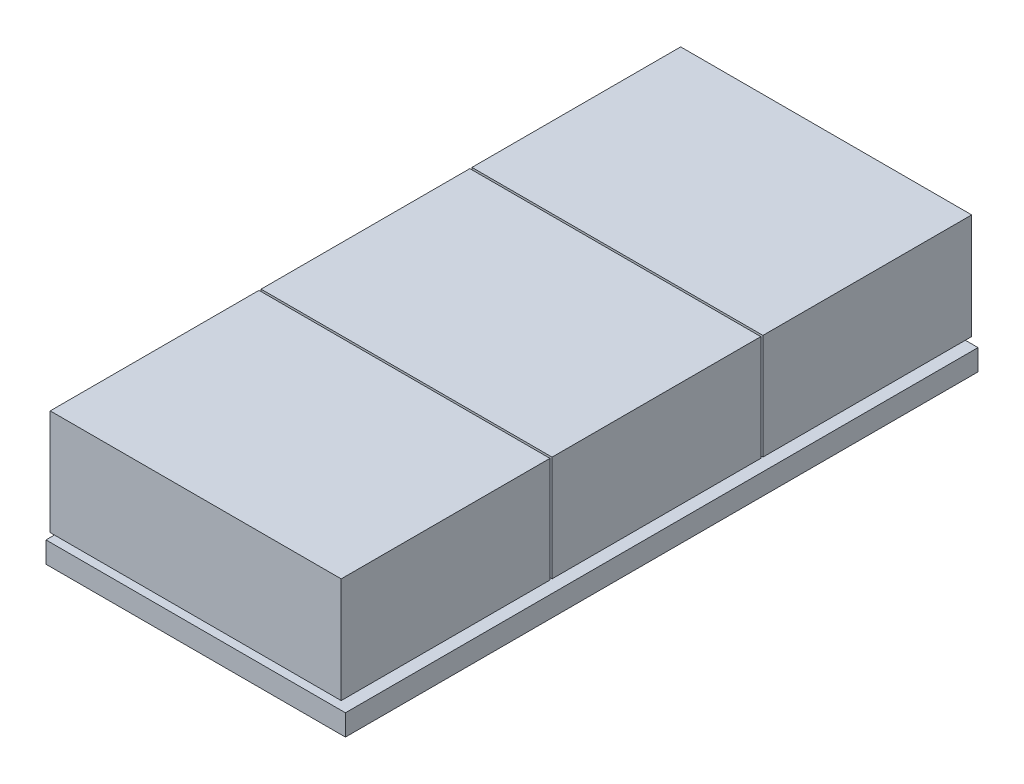
ISO-10303-21;
HEADER;
FILE_DESCRIPTION(('STEP AP214'),'2;1');
FILE_NAME('part.step','',(''),(''),'','','');
FILE_SCHEMA(('AUTOMOTIVE_DESIGN { 1 0 10303 214 1 1 1 1 }'));
ENDSEC;
DATA;
#1=APPLICATION_CONTEXT('core data for automotive mechanical design processes');
#2=APPLICATION_PROTOCOL_DEFINITION('international standard','automotive_design',2000,#1);
#3=PRODUCT_CONTEXT('',#1,'mechanical');
#4=PRODUCT('Part','Part','',(#3));
#5=PRODUCT_RELATED_PRODUCT_CATEGORY('part','',(#4));
#6=PRODUCT_DEFINITION_FORMATION('','',#4);
#7=PRODUCT_DEFINITION_CONTEXT('part definition',#1,'design');
#8=PRODUCT_DEFINITION('design','',#6,#7);
#9=PRODUCT_DEFINITION_SHAPE('','',#8);
#10=(LENGTH_UNIT() NAMED_UNIT(*) SI_UNIT(.MILLI.,.METRE.));
#11=(NAMED_UNIT(*) PLANE_ANGLE_UNIT() SI_UNIT($,.RADIAN.));
#12=(NAMED_UNIT(*) SI_UNIT($,.STERADIAN.) SOLID_ANGLE_UNIT());
#13=UNCERTAINTY_MEASURE_WITH_UNIT(LENGTH_MEASURE(1.E-05),#10,'distance_accuracy_value','');
#14=(GEOMETRIC_REPRESENTATION_CONTEXT(3) GLOBAL_UNCERTAINTY_ASSIGNED_CONTEXT((#13)) GLOBAL_UNIT_ASSIGNED_CONTEXT((#10,
#11,#12)) REPRESENTATION_CONTEXT('',''));
#15=CARTESIAN_POINT('',(0.,0.,0.));
#16=DIRECTION('',(0.,0.,1.));
#17=DIRECTION('',(1.,0.,0.));
#18=AXIS2_PLACEMENT_3D('',#15,#16,#17);
#19=CARTESIAN_POINT('',(-32.5,7.,-27.5));
#20=DIRECTION('',(0.,0.,-1.));
#21=DIRECTION('',(-1.,0.,0.));
#22=AXIS2_PLACEMENT_3D('',#19,#20,#21);
#23=PLANE('',#22);
#24=DIRECTION('',(1.,0.,0.));
#25=VECTOR('',#24,1.);
#26=CARTESIAN_POINT('',(-32.5,5.,-27.5));
#27=LINE('',#26,#25);
#28=CARTESIAN_POINT('',(-32.5,5.,-27.5));
#29=VERTEX_POINT('',#28);
#30=CARTESIAN_POINT('',(32.5,5.,-27.5));
#31=VERTEX_POINT('',#30);
#32=EDGE_CURVE('E416',#29,#31,#27,.T.);
#33=ORIENTED_EDGE('',*,*,#32,.T.);
#34=DIRECTION('',(0.,-1.,0.));
#35=VECTOR('',#34,1.);
#36=CARTESIAN_POINT('',(32.5,7.,-27.5));
#37=LINE('',#36,#35);
#38=CARTESIAN_POINT('',(32.5,7.,-27.5));
#39=VERTEX_POINT('',#38);
#40=EDGE_CURVE('E429',#39,#31,#37,.T.);
#41=ORIENTED_EDGE('',*,*,#40,.F.);
#42=DIRECTION('',(1.,0.,0.));
#43=VECTOR('',#42,1.);
#44=CARTESIAN_POINT('',(-32.5,7.,-27.5));
#45=LINE('',#44,#43);
#46=CARTESIAN_POINT('',(-32.5,7.,-27.5));
#47=VERTEX_POINT('',#46);
#48=EDGE_CURVE('E11',#47,#39,#45,.T.);
#49=ORIENTED_EDGE('',*,*,#48,.F.);
#50=DIRECTION('',(0.,-1.,0.));
#51=VECTOR('',#50,1.);
#52=CARTESIAN_POINT('',(-32.5,7.,-27.5));
#53=LINE('',#52,#51);
#54=EDGE_CURVE('E49',#47,#29,#53,.T.);
#55=ORIENTED_EDGE('',*,*,#54,.T.);
#56=EDGE_LOOP('',(#33,#41,#49,#55));
#57=FACE_BOUND('',#56,.T.);
#58=ADVANCED_FACE('F35',(#57),#23,.F.);
#59=CARTESIAN_POINT('',(-32.5,7.,-72.5));
#60=DIRECTION('',(1.,0.,0.));
#61=DIRECTION('',(0.,0.,-1.));
#62=AXIS2_PLACEMENT_3D('',#59,#60,#61);
#63=PLANE('',#62);
#64=DIRECTION('',(0.,0.,1.));
#65=VECTOR('',#64,1.);
#66=CARTESIAN_POINT('',(-32.5,5.,-72.5));
#67=LINE('',#66,#65);
#68=CARTESIAN_POINT('',(-32.5,5.,-72.5));
#69=VERTEX_POINT('',#68);
#70=EDGE_CURVE('E419',#69,#29,#67,.T.);
#71=ORIENTED_EDGE('',*,*,#70,.T.);
#72=ORIENTED_EDGE('',*,*,#54,.F.);
#73=DIRECTION('',(0.,0.,1.));
#74=VECTOR('',#73,1.);
#75=CARTESIAN_POINT('',(-32.5,7.,-72.5));
#76=LINE('',#75,#74);
#77=CARTESIAN_POINT('',(-32.5,7.,-72.5));
#78=VERTEX_POINT('',#77);
#79=EDGE_CURVE('E42',#78,#47,#76,.T.);
#80=ORIENTED_EDGE('',*,*,#79,.F.);
#81=DIRECTION('',(0.,-1.,0.));
#82=VECTOR('',#81,1.);
#83=CARTESIAN_POINT('',(-32.5,7.,-72.5));
#84=LINE('',#83,#82);
#85=EDGE_CURVE('E57',#78,#69,#84,.T.);
#86=ORIENTED_EDGE('',*,*,#85,.T.);
#87=EDGE_LOOP('',(#71,#72,#80,#86));
#88=FACE_BOUND('',#87,.T.);
#89=ADVANCED_FACE('F439',(#88),#63,.F.);
#90=CARTESIAN_POINT('',(-32.5,7.,-72.5));
#91=DIRECTION('',(0.,0.,1.));
#92=DIRECTION('',(1.,0.,0.));
#93=AXIS2_PLACEMENT_3D('',#90,#91,#92);
#94=PLANE('',#93);
#95=DIRECTION('',(-1.,0.,0.));
#96=VECTOR('',#95,1.);
#97=CARTESIAN_POINT('',(-32.5,5.,-72.5));
#98=LINE('',#97,#96);
#99=CARTESIAN_POINT('',(32.5,5.,-72.5));
#100=VERTEX_POINT('',#99);
#101=EDGE_CURVE('E421',#100,#69,#98,.T.);
#102=ORIENTED_EDGE('',*,*,#101,.T.);
#103=ORIENTED_EDGE('',*,*,#85,.F.);
#104=DIRECTION('',(-1.,0.,0.));
#105=VECTOR('',#104,1.);
#106=CARTESIAN_POINT('',(-32.5,7.,-72.5));
#107=LINE('',#106,#105);
#108=CARTESIAN_POINT('',(32.5,7.,-72.5));
#109=VERTEX_POINT('',#108);
#110=EDGE_CURVE('E433',#109,#78,#107,.T.);
#111=ORIENTED_EDGE('',*,*,#110,.F.);
#112=DIRECTION('',(0.,-1.,0.));
#113=VECTOR('',#112,1.);
#114=CARTESIAN_POINT('',(32.5,7.,-72.5));
#115=LINE('',#114,#113);
#116=EDGE_CURVE('E423',#109,#100,#115,.T.);
#117=ORIENTED_EDGE('',*,*,#116,.T.);
#118=EDGE_LOOP('',(#102,#103,#111,#117));
#119=FACE_BOUND('',#118,.T.);
#120=ADVANCED_FACE('F446',(#119),#94,.F.);
#121=CARTESIAN_POINT('',(32.5,7.,-72.5));
#122=DIRECTION('',(-1.,0.,0.));
#123=DIRECTION('',(0.,0.,1.));
#124=AXIS2_PLACEMENT_3D('',#121,#122,#123);
#125=PLANE('',#124);
#126=DIRECTION('',(0.,0.,-1.));
#127=VECTOR('',#126,1.);
#128=CARTESIAN_POINT('',(32.5,5.,-72.5));
#129=LINE('',#128,#127);
#130=EDGE_CURVE('E414',#31,#100,#129,.T.);
#131=ORIENTED_EDGE('',*,*,#130,.T.);
#132=ORIENTED_EDGE('',*,*,#116,.F.);
#133=DIRECTION('',(0.,0.,-1.));
#134=VECTOR('',#133,1.);
#135=CARTESIAN_POINT('',(32.5,7.,-72.5));
#136=LINE('',#135,#134);
#137=EDGE_CURVE('E426',#39,#109,#136,.T.);
#138=ORIENTED_EDGE('',*,*,#137,.F.);
#139=ORIENTED_EDGE('',*,*,#40,.T.);
#140=EDGE_LOOP('',(#131,#132,#138,#139));
#141=FACE_BOUND('',#140,.T.);
#142=ADVANCED_FACE('F445',(#141),#125,.F.);
#143=CARTESIAN_POINT('',(0.,5.,0.));
#144=DIRECTION('',(0.,-1.,0.));
#145=DIRECTION('',(0.,0.,-1.));
#146=AXIS2_PLACEMENT_3D('',#143,#144,#145);
#147=PLANE('',#146);
#148=DIRECTION('',(0.,0.,-1.));
#149=VECTOR('',#148,1.);
#150=CARTESIAN_POINT('',(32.5,5.,27.5));
#151=LINE('',#150,#149);
#152=CARTESIAN_POINT('',(32.5,5.,72.5));
#153=VERTEX_POINT('',#152);
#154=CARTESIAN_POINT('',(32.5,5.,27.5));
#155=VERTEX_POINT('',#154);
#156=EDGE_CURVE('E348',#153,#155,#151,.T.);
#157=ORIENTED_EDGE('',*,*,#156,.F.);
#158=DIRECTION('',(1.,0.,0.));
#159=VECTOR('',#158,1.);
#160=CARTESIAN_POINT('',(-32.5,5.,72.5));
#161=LINE('',#160,#159);
#162=CARTESIAN_POINT('',(-32.5,5.,72.5));
#163=VERTEX_POINT('',#162);
#164=EDGE_CURVE('E353',#163,#153,#161,.T.);
#165=ORIENTED_EDGE('',*,*,#164,.F.);
#166=DIRECTION('',(0.,0.,1.));
#167=VECTOR('',#166,1.);
#168=CARTESIAN_POINT('',(-32.5,5.,27.5));
#169=LINE('',#168,#167);
#170=CARTESIAN_POINT('',(-32.5,5.,27.5));
#171=VERTEX_POINT('',#170);
#172=EDGE_CURVE('E368',#171,#163,#169,.T.);
#173=ORIENTED_EDGE('',*,*,#172,.F.);
#174=DIRECTION('',(-1.,0.,0.));
#175=VECTOR('',#174,1.);
#176=CARTESIAN_POINT('',(-32.5,5.,27.5));
#177=LINE('',#176,#175);
#178=EDGE_CURVE('E365',#155,#171,#177,.T.);
#179=ORIENTED_EDGE('',*,*,#178,.F.);
#180=EDGE_LOOP('',(#157,#165,#173,#179));
#181=FACE_BOUND('',#180,.T.);
#182=DIRECTION('',(0.,0.,-1.));
#183=VECTOR('',#182,1.);
#184=CARTESIAN_POINT('',(35.5,5.,75.));
#185=LINE('',#184,#183);
#186=CARTESIAN_POINT('',(35.5,5.,75.));
#187=VERTEX_POINT('',#186);
#188=CARTESIAN_POINT('',(35.5,5.,-75.));
#189=VERTEX_POINT('',#188);
#190=EDGE_CURVE('E385',#187,#189,#185,.T.);
#191=ORIENTED_EDGE('',*,*,#190,.T.);
#192=DIRECTION('',(-1.,0.,0.));
#193=VECTOR('',#192,1.);
#194=CARTESIAN_POINT('',(-35.5,5.,-75.));
#195=LINE('',#194,#193);
#196=CARTESIAN_POINT('',(-35.5,5.,-75.));
#197=VERTEX_POINT('',#196);
#198=EDGE_CURVE('E388',#189,#197,#195,.T.);
#199=ORIENTED_EDGE('',*,*,#198,.T.);
#200=DIRECTION('',(0.,0.,1.));
#201=VECTOR('',#200,1.);
#202=CARTESIAN_POINT('',(-35.5,5.,75.));
#203=LINE('',#202,#201);
#204=CARTESIAN_POINT('',(-35.5,5.,75.));
#205=VERTEX_POINT('',#204);
#206=EDGE_CURVE('E391',#197,#205,#203,.T.);
#207=ORIENTED_EDGE('',*,*,#206,.T.);
#208=DIRECTION('',(1.,0.,0.));
#209=VECTOR('',#208,1.);
#210=CARTESIAN_POINT('',(-35.5,5.,75.));
#211=LINE('',#210,#209);
#212=EDGE_CURVE('E393',#205,#187,#211,.T.);
#213=ORIENTED_EDGE('',*,*,#212,.T.);
#214=EDGE_LOOP('',(#191,#199,#207,#213));
#215=FACE_BOUND('',#214,.T.);
#216=DIRECTION('',(0.,0.,-1.));
#217=VECTOR('',#216,1.);
#218=CARTESIAN_POINT('',(32.5,5.,-22.5));
#219=LINE('',#218,#217);
#220=CARTESIAN_POINT('',(32.5,5.,22.5));
#221=VERTEX_POINT('',#220);
#222=CARTESIAN_POINT('',(32.5,5.,-22.5));
#223=VERTEX_POINT('',#222);
#224=EDGE_CURVE('E345',#221,#223,#219,.T.);
#225=ORIENTED_EDGE('',*,*,#224,.F.);
#226=DIRECTION('',(1.,0.,0.));
#227=VECTOR('',#226,1.);
#228=CARTESIAN_POINT('',(-32.5,5.,22.5));
#229=LINE('',#228,#227);
#230=CARTESIAN_POINT('',(-32.5,5.,22.5));
#231=VERTEX_POINT('',#230);
#232=EDGE_CURVE('E312',#231,#221,#229,.T.);
#233=ORIENTED_EDGE('',*,*,#232,.F.);
#234=DIRECTION('',(0.,0.,1.));
#235=VECTOR('',#234,1.);
#236=CARTESIAN_POINT('',(-32.5,5.,-22.5));
#237=LINE('',#236,#235);
#238=CARTESIAN_POINT('',(-32.5,5.,-22.5));
#239=VERTEX_POINT('',#238);
#240=EDGE_CURVE('E333',#239,#231,#237,.T.);
#241=ORIENTED_EDGE('',*,*,#240,.F.);
#242=DIRECTION('',(-1.,0.,0.));
#243=VECTOR('',#242,1.);
#244=CARTESIAN_POINT('',(-32.5,5.,-22.5));
#245=LINE('',#244,#243);
#246=EDGE_CURVE('E339',#223,#239,#245,.T.);
#247=ORIENTED_EDGE('',*,*,#246,.F.);
#248=EDGE_LOOP('',(#225,#233,#241,#247));
#249=FACE_BOUND('',#248,.T.);
#250=ORIENTED_EDGE('',*,*,#130,.F.);
#251=ORIENTED_EDGE('',*,*,#32,.F.);
#252=ORIENTED_EDGE('',*,*,#70,.F.);
#253=ORIENTED_EDGE('',*,*,#101,.F.);
#254=EDGE_LOOP('',(#250,#251,#252,#253));
#255=FACE_BOUND('',#254,.T.);
#256=ADVANCED_FACE('F453',(#181,#215,#249,#255),#147,.F.);
#257=CARTESIAN_POINT('',(35.5,5.,75.));
#258=DIRECTION('',(-1.,0.,0.));
#259=DIRECTION('',(0.,0.,1.));
#260=AXIS2_PLACEMENT_3D('',#257,#258,#259);
#261=PLANE('',#260);
#262=DIRECTION('',(0.,0.,-1.));
#263=VECTOR('',#262,1.);
#264=CARTESIAN_POINT('',(35.5,0.,75.));
#265=LINE('',#264,#263);
#266=CARTESIAN_POINT('',(35.5,0.,75.));
#267=VERTEX_POINT('',#266);
#268=CARTESIAN_POINT('',(35.5,0.,-75.));
#269=VERTEX_POINT('',#268);
#270=EDGE_CURVE('E384',#267,#269,#265,.T.);
#271=ORIENTED_EDGE('',*,*,#270,.T.);
#272=DIRECTION('',(0.,-1.,0.));
#273=VECTOR('',#272,1.);
#274=CARTESIAN_POINT('',(35.5,5.,-75.));
#275=LINE('',#274,#273);
#276=EDGE_CURVE('E411',#189,#269,#275,.T.);
#277=ORIENTED_EDGE('',*,*,#276,.F.);
#278=ORIENTED_EDGE('',*,*,#190,.F.);
#279=DIRECTION('',(0.,-1.,0.));
#280=VECTOR('',#279,1.);
#281=CARTESIAN_POINT('',(35.5,5.,75.));
#282=LINE('',#281,#280);
#283=EDGE_CURVE('E395',#187,#267,#282,.T.);
#284=ORIENTED_EDGE('',*,*,#283,.T.);
#285=EDGE_LOOP('',(#271,#277,#278,#284));
#286=FACE_BOUND('',#285,.T.);
#287=ADVANCED_FACE('F725',(#286),#261,.F.);
#288=CARTESIAN_POINT('',(-35.5,5.,-75.));
#289=DIRECTION('',(0.,0.,1.));
#290=DIRECTION('',(1.,0.,0.));
#291=AXIS2_PLACEMENT_3D('',#288,#289,#290);
#292=PLANE('',#291);
#293=DIRECTION('',(-1.,0.,0.));
#294=VECTOR('',#293,1.);
#295=CARTESIAN_POINT('',(-35.5,0.,-75.));
#296=LINE('',#295,#294);
#297=CARTESIAN_POINT('',(-35.5,0.,-75.));
#298=VERTEX_POINT('',#297);
#299=EDGE_CURVE('E398',#269,#298,#296,.T.);
#300=ORIENTED_EDGE('',*,*,#299,.T.);
#301=DIRECTION('',(0.,-1.,0.));
#302=VECTOR('',#301,1.);
#303=CARTESIAN_POINT('',(-35.5,5.,-75.));
#304=LINE('',#303,#302);
#305=EDGE_CURVE('E408',#197,#298,#304,.T.);
#306=ORIENTED_EDGE('',*,*,#305,.F.);
#307=ORIENTED_EDGE('',*,*,#198,.F.);
#308=ORIENTED_EDGE('',*,*,#276,.T.);
#309=EDGE_LOOP('',(#300,#306,#307,#308));
#310=FACE_BOUND('',#309,.T.);
#311=ADVANCED_FACE('F787',(#310),#292,.F.);
#312=CARTESIAN_POINT('',(-35.5,5.,75.));
#313=DIRECTION('',(1.,0.,0.));
#314=DIRECTION('',(0.,0.,-1.));
#315=AXIS2_PLACEMENT_3D('',#312,#313,#314);
#316=PLANE('',#315);
#317=DIRECTION('',(0.,0.,1.));
#318=VECTOR('',#317,1.);
#319=CARTESIAN_POINT('',(-35.5,0.,75.));
#320=LINE('',#319,#318);
#321=CARTESIAN_POINT('',(-35.5,0.,75.));
#322=VERTEX_POINT('',#321);
#323=EDGE_CURVE('E400',#298,#322,#320,.T.);
#324=ORIENTED_EDGE('',*,*,#323,.T.);
#325=DIRECTION('',(0.,-1.,0.));
#326=VECTOR('',#325,1.);
#327=CARTESIAN_POINT('',(-35.5,5.,75.));
#328=LINE('',#327,#326);
#329=EDGE_CURVE('E405',#205,#322,#328,.T.);
#330=ORIENTED_EDGE('',*,*,#329,.F.);
#331=ORIENTED_EDGE('',*,*,#206,.F.);
#332=ORIENTED_EDGE('',*,*,#305,.T.);
#333=EDGE_LOOP('',(#324,#330,#331,#332));
#334=FACE_BOUND('',#333,.T.);
#335=ADVANCED_FACE('F778',(#334),#316,.F.);
#336=CARTESIAN_POINT('',(-35.5,5.,75.));
#337=DIRECTION('',(0.,0.,-1.));
#338=DIRECTION('',(-1.,0.,0.));
#339=AXIS2_PLACEMENT_3D('',#336,#337,#338);
#340=PLANE('',#339);
#341=DIRECTION('',(1.,0.,0.));
#342=VECTOR('',#341,1.);
#343=CARTESIAN_POINT('',(-35.5,0.,75.));
#344=LINE('',#343,#342);
#345=EDGE_CURVE('E389',#322,#267,#344,.T.);
#346=ORIENTED_EDGE('',*,*,#345,.T.);
#347=ORIENTED_EDGE('',*,*,#283,.F.);
#348=ORIENTED_EDGE('',*,*,#212,.F.);
#349=ORIENTED_EDGE('',*,*,#329,.T.);
#350=EDGE_LOOP('',(#346,#347,#348,#349));
#351=FACE_BOUND('',#350,.T.);
#352=ADVANCED_FACE('F769',(#351),#340,.F.);
#353=CARTESIAN_POINT('',(0.,0.,0.));
#354=DIRECTION('',(0.,-1.,0.));
#355=DIRECTION('',(0.,0.,-1.));
#356=AXIS2_PLACEMENT_3D('',#353,#354,#355);
#357=PLANE('',#356);
#358=ORIENTED_EDGE('',*,*,#270,.F.);
#359=ORIENTED_EDGE('',*,*,#345,.F.);
#360=ORIENTED_EDGE('',*,*,#323,.F.);
#361=ORIENTED_EDGE('',*,*,#299,.F.);
#362=EDGE_LOOP('',(#358,#359,#360,#361));
#363=FACE_BOUND('',#362,.T.);
#364=ADVANCED_FACE('F761',(#363),#357,.T.);
#365=CARTESIAN_POINT('',(32.5,7.,27.5));
#366=DIRECTION('',(-1.,0.,0.));
#367=DIRECTION('',(0.,0.,1.));
#368=AXIS2_PLACEMENT_3D('',#365,#366,#367);
#369=PLANE('',#368);
#370=ORIENTED_EDGE('',*,*,#156,.T.);
#371=DIRECTION('',(0.,-1.,0.));
#372=VECTOR('',#371,1.);
#373=CARTESIAN_POINT('',(32.5,7.,27.5));
#374=LINE('',#373,#372);
#375=CARTESIAN_POINT('',(32.5,7.,27.5));
#376=VERTEX_POINT('',#375);
#377=EDGE_CURVE('E381',#376,#155,#374,.T.);
#378=ORIENTED_EDGE('',*,*,#377,.F.);
#379=DIRECTION('',(0.,0.,-1.));
#380=VECTOR('',#379,1.);
#381=CARTESIAN_POINT('',(32.5,7.,27.5));
#382=LINE('',#381,#380);
#383=CARTESIAN_POINT('',(32.5,7.,72.5));
#384=VERTEX_POINT('',#383);
#385=EDGE_CURVE('E349',#384,#376,#382,.T.);
#386=ORIENTED_EDGE('',*,*,#385,.F.);
#387=DIRECTION('',(0.,-1.,0.));
#388=VECTOR('',#387,1.);
#389=CARTESIAN_POINT('',(32.5,7.,72.5));
#390=LINE('',#389,#388);
#391=EDGE_CURVE('E362',#384,#153,#390,.T.);
#392=ORIENTED_EDGE('',*,*,#391,.T.);
#393=EDGE_LOOP('',(#370,#378,#386,#392));
#394=FACE_BOUND('',#393,.T.);
#395=ADVANCED_FACE('F753',(#394),#369,.F.);
#396=CARTESIAN_POINT('',(-32.5,7.,27.5));
#397=DIRECTION('',(0.,0.,1.));
#398=DIRECTION('',(1.,0.,0.));
#399=AXIS2_PLACEMENT_3D('',#396,#397,#398);
#400=PLANE('',#399);
#401=ORIENTED_EDGE('',*,*,#178,.T.);
#402=DIRECTION('',(0.,-1.,0.));
#403=VECTOR('',#402,1.);
#404=CARTESIAN_POINT('',(-32.5,7.,27.5));
#405=LINE('',#404,#403);
#406=CARTESIAN_POINT('',(-32.5,7.,27.5));
#407=VERTEX_POINT('',#406);
#408=EDGE_CURVE('E378',#407,#171,#405,.T.);
#409=ORIENTED_EDGE('',*,*,#408,.F.);
#410=DIRECTION('',(-1.,0.,0.));
#411=VECTOR('',#410,1.);
#412=CARTESIAN_POINT('',(-32.5,7.,27.5));
#413=LINE('',#412,#411);
#414=EDGE_CURVE('E352',#376,#407,#413,.T.);
#415=ORIENTED_EDGE('',*,*,#414,.F.);
#416=ORIENTED_EDGE('',*,*,#377,.T.);
#417=EDGE_LOOP('',(#401,#409,#415,#416));
#418=FACE_BOUND('',#417,.T.);
#419=ADVANCED_FACE('F744',(#418),#400,.F.);
#420=CARTESIAN_POINT('',(-32.5,7.,27.5));
#421=DIRECTION('',(1.,0.,0.));
#422=DIRECTION('',(0.,0.,-1.));
#423=AXIS2_PLACEMENT_3D('',#420,#421,#422);
#424=PLANE('',#423);
#425=ORIENTED_EDGE('',*,*,#172,.T.);
#426=DIRECTION('',(0.,-1.,0.));
#427=VECTOR('',#426,1.);
#428=CARTESIAN_POINT('',(-32.5,7.,72.5));
#429=LINE('',#428,#427);
#430=CARTESIAN_POINT('',(-32.5,7.,72.5));
#431=VERTEX_POINT('',#430);
#432=EDGE_CURVE('E375',#431,#163,#429,.T.);
#433=ORIENTED_EDGE('',*,*,#432,.F.);
#434=DIRECTION('',(0.,0.,1.));
#435=VECTOR('',#434,1.);
#436=CARTESIAN_POINT('',(-32.5,7.,27.5));
#437=LINE('',#436,#435);
#438=EDGE_CURVE('E356',#407,#431,#437,.T.);
#439=ORIENTED_EDGE('',*,*,#438,.F.);
#440=ORIENTED_EDGE('',*,*,#408,.T.);
#441=EDGE_LOOP('',(#425,#433,#439,#440));
#442=FACE_BOUND('',#441,.T.);
#443=ADVANCED_FACE('F735',(#442),#424,.F.);
#444=CARTESIAN_POINT('',(-32.5,7.,72.5));
#445=DIRECTION('',(0.,0.,-1.));
#446=DIRECTION('',(-1.,0.,0.));
#447=AXIS2_PLACEMENT_3D('',#444,#445,#446);
#448=PLANE('',#447);
#449=ORIENTED_EDGE('',*,*,#164,.T.);
#450=ORIENTED_EDGE('',*,*,#391,.F.);
#451=DIRECTION('',(1.,0.,0.));
#452=VECTOR('',#451,1.);
#453=CARTESIAN_POINT('',(-32.5,7.,72.5));
#454=LINE('',#453,#452);
#455=EDGE_CURVE('E359',#431,#384,#454,.T.);
#456=ORIENTED_EDGE('',*,*,#455,.F.);
#457=ORIENTED_EDGE('',*,*,#432,.T.);
#458=EDGE_LOOP('',(#449,#450,#456,#457));
#459=FACE_BOUND('',#458,.T.);
#460=ADVANCED_FACE('F706',(#459),#448,.F.);
#461=CARTESIAN_POINT('',(32.5,7.,-22.5));
#462=DIRECTION('',(-1.,0.,0.));
#463=DIRECTION('',(0.,0.,1.));
#464=AXIS2_PLACEMENT_3D('',#461,#462,#463);
#465=PLANE('',#464);
#466=ORIENTED_EDGE('',*,*,#224,.T.);
#467=DIRECTION('',(0.,-1.,0.));
#468=VECTOR('',#467,1.);
#469=CARTESIAN_POINT('',(32.5,7.,-22.5));
#470=LINE('',#469,#468);
#471=CARTESIAN_POINT('',(32.5,7.,-22.5));
#472=VERTEX_POINT('',#471);
#473=EDGE_CURVE('E342',#472,#223,#470,.T.);
#474=ORIENTED_EDGE('',*,*,#473,.F.);
#475=DIRECTION('',(0.,0.,-1.));
#476=VECTOR('',#475,1.);
#477=CARTESIAN_POINT('',(32.5,7.,-22.5));
#478=LINE('',#477,#476);
#479=CARTESIAN_POINT('',(32.5,7.,22.5));
#480=VERTEX_POINT('',#479);
#481=EDGE_CURVE('E315',#480,#472,#478,.T.);
#482=ORIENTED_EDGE('',*,*,#481,.F.);
#483=DIRECTION('',(0.,-1.,0.));
#484=VECTOR('',#483,1.);
#485=CARTESIAN_POINT('',(32.5,7.,22.5));
#486=LINE('',#485,#484);
#487=EDGE_CURVE('E327',#480,#221,#486,.T.);
#488=ORIENTED_EDGE('',*,*,#487,.T.);
#489=EDGE_LOOP('',(#466,#474,#482,#488));
#490=FACE_BOUND('',#489,.T.);
#491=ADVANCED_FACE('F698',(#490),#465,.F.);
#492=CARTESIAN_POINT('',(-32.5,7.,-22.5));
#493=DIRECTION('',(0.,0.,1.));
#494=DIRECTION('',(1.,0.,0.));
#495=AXIS2_PLACEMENT_3D('',#492,#493,#494);
#496=PLANE('',#495);
#497=ORIENTED_EDGE('',*,*,#246,.T.);
#498=DIRECTION('',(0.,-1.,0.));
#499=VECTOR('',#498,1.);
#500=CARTESIAN_POINT('',(-32.5,7.,-22.5));
#501=LINE('',#500,#499);
#502=CARTESIAN_POINT('',(-32.5,7.,-22.5));
#503=VERTEX_POINT('',#502);
#504=EDGE_CURVE('E336',#503,#239,#501,.T.);
#505=ORIENTED_EDGE('',*,*,#504,.F.);
#506=DIRECTION('',(-1.,0.,0.));
#507=VECTOR('',#506,1.);
#508=CARTESIAN_POINT('',(-32.5,7.,-22.5));
#509=LINE('',#508,#507);
#510=EDGE_CURVE('E318',#472,#503,#509,.T.);
#511=ORIENTED_EDGE('',*,*,#510,.F.);
#512=ORIENTED_EDGE('',*,*,#473,.T.);
#513=EDGE_LOOP('',(#497,#505,#511,#512));
#514=FACE_BOUND('',#513,.T.);
#515=ADVANCED_FACE('F688',(#514),#496,.F.);
#516=CARTESIAN_POINT('',(-32.5,7.,-22.5));
#517=DIRECTION('',(1.,0.,0.));
#518=DIRECTION('',(0.,0.,-1.));
#519=AXIS2_PLACEMENT_3D('',#516,#517,#518);
#520=PLANE('',#519);
#521=ORIENTED_EDGE('',*,*,#240,.T.);
#522=DIRECTION('',(0.,-1.,0.));
#523=VECTOR('',#522,1.);
#524=CARTESIAN_POINT('',(-32.5,7.,22.5));
#525=LINE('',#524,#523);
#526=CARTESIAN_POINT('',(-32.5,7.,22.5));
#527=VERTEX_POINT('',#526);
#528=EDGE_CURVE('E330',#527,#231,#525,.T.);
#529=ORIENTED_EDGE('',*,*,#528,.F.);
#530=DIRECTION('',(0.,0.,1.));
#531=VECTOR('',#530,1.);
#532=CARTESIAN_POINT('',(-32.5,7.,-22.5));
#533=LINE('',#532,#531);
#534=EDGE_CURVE('E321',#503,#527,#533,.T.);
#535=ORIENTED_EDGE('',*,*,#534,.F.);
#536=ORIENTED_EDGE('',*,*,#504,.T.);
#537=EDGE_LOOP('',(#521,#529,#535,#536));
#538=FACE_BOUND('',#537,.T.);
#539=ADVANCED_FACE('F678',(#538),#520,.F.);
#540=CARTESIAN_POINT('',(-32.5,7.,22.5));
#541=DIRECTION('',(0.,0.,-1.));
#542=DIRECTION('',(-1.,0.,0.));
#543=AXIS2_PLACEMENT_3D('',#540,#541,#542);
#544=PLANE('',#543);
#545=ORIENTED_EDGE('',*,*,#232,.T.);
#546=ORIENTED_EDGE('',*,*,#487,.F.);
#547=DIRECTION('',(1.,0.,0.));
#548=VECTOR('',#547,1.);
#549=CARTESIAN_POINT('',(-32.5,7.,22.5));
#550=LINE('',#549,#548);
#551=EDGE_CURVE('E324',#527,#480,#550,.T.);
#552=ORIENTED_EDGE('',*,*,#551,.F.);
#553=ORIENTED_EDGE('',*,*,#528,.T.);
#554=EDGE_LOOP('',(#545,#546,#552,#553));
#555=FACE_BOUND('',#554,.T.);
#556=ADVANCED_FACE('F669',(#555),#544,.F.);
#557=CARTESIAN_POINT('',(0.,7.,0.));
#558=DIRECTION('',(0.,1.,0.));
#559=DIRECTION('',(0.,0.,1.));
#560=AXIS2_PLACEMENT_3D('',#557,#558,#559);
#561=PLANE('',#560);
#562=DIRECTION('',(0.,0.,-1.));
#563=VECTOR('',#562,1.);
#564=CARTESIAN_POINT('',(34.5,7.,25.5));
#565=LINE('',#564,#563);
#566=CARTESIAN_POINT('',(34.5,7.,75.));
#567=VERTEX_POINT('',#566);
#568=CARTESIAN_POINT('',(34.5,7.,25.5));
#569=VERTEX_POINT('',#568);
#570=EDGE_CURVE('E282',#567,#569,#565,.T.);
#571=ORIENTED_EDGE('',*,*,#570,.F.);
#572=DIRECTION('',(1.,0.,0.));
#573=VECTOR('',#572,1.);
#574=CARTESIAN_POINT('',(-34.5,7.,75.));
#575=LINE('',#574,#573);
#576=CARTESIAN_POINT('',(-34.5,7.,75.));
#577=VERTEX_POINT('',#576);
#578=EDGE_CURVE('E287',#577,#567,#575,.T.);
#579=ORIENTED_EDGE('',*,*,#578,.F.);
#580=DIRECTION('',(0.,0.,1.));
#581=VECTOR('',#580,1.);
#582=CARTESIAN_POINT('',(-34.5,7.,25.5));
#583=LINE('',#582,#581);
#584=CARTESIAN_POINT('',(-34.5,7.,25.5));
#585=VERTEX_POINT('',#584);
#586=EDGE_CURVE('E298',#585,#577,#583,.T.);
#587=ORIENTED_EDGE('',*,*,#586,.F.);
#588=DIRECTION('',(-1.,0.,0.));
#589=VECTOR('',#588,1.);
#590=CARTESIAN_POINT('',(-34.5,7.,25.5));
#591=LINE('',#590,#589);
#592=EDGE_CURVE('E296',#569,#585,#591,.T.);
#593=ORIENTED_EDGE('',*,*,#592,.F.);
#594=EDGE_LOOP('',(#571,#579,#587,#593));
#595=FACE_BOUND('',#594,.T.);
#596=ORIENTED_EDGE('',*,*,#455,.T.);
#597=ORIENTED_EDGE('',*,*,#385,.T.);
#598=ORIENTED_EDGE('',*,*,#414,.T.);
#599=ORIENTED_EDGE('',*,*,#438,.T.);
#600=EDGE_LOOP('',(#596,#597,#598,#599));
#601=FACE_BOUND('',#600,.T.);
#602=ADVANCED_FACE('F660',(#595,#601),#561,.F.);
#603=CARTESIAN_POINT('',(34.5,32.,25.5));
#604=DIRECTION('',(-1.,0.,0.));
#605=DIRECTION('',(0.,0.,1.));
#606=AXIS2_PLACEMENT_3D('',#603,#604,#605);
#607=PLANE('',#606);
#608=ORIENTED_EDGE('',*,*,#570,.T.);
#609=DIRECTION('',(0.,-1.,0.));
#610=VECTOR('',#609,1.);
#611=CARTESIAN_POINT('',(34.5,32.,25.5));
#612=LINE('',#611,#610);
#613=CARTESIAN_POINT('',(34.5,32.,25.5));
#614=VERTEX_POINT('',#613);
#615=EDGE_CURVE('E309',#614,#569,#612,.T.);
#616=ORIENTED_EDGE('',*,*,#615,.F.);
#617=DIRECTION('',(0.,0.,-1.));
#618=VECTOR('',#617,1.);
#619=CARTESIAN_POINT('',(34.5,32.,25.5));
#620=LINE('',#619,#618);
#621=CARTESIAN_POINT('',(34.5,32.,75.));
#622=VERTEX_POINT('',#621);
#623=EDGE_CURVE('E283',#622,#614,#620,.T.);
#624=ORIENTED_EDGE('',*,*,#623,.F.);
#625=DIRECTION('',(0.,-1.,0.));
#626=VECTOR('',#625,1.);
#627=CARTESIAN_POINT('',(34.5,32.,75.));
#628=LINE('',#627,#626);
#629=EDGE_CURVE('E293',#622,#567,#628,.T.);
#630=ORIENTED_EDGE('',*,*,#629,.T.);
#631=EDGE_LOOP('',(#608,#616,#624,#630));
#632=FACE_BOUND('',#631,.T.);
#633=ADVANCED_FACE('F651',(#632),#607,.F.);
#634=CARTESIAN_POINT('',(-34.5,32.,25.5));
#635=DIRECTION('',(0.,0.,1.));
#636=DIRECTION('',(1.,0.,0.));
#637=AXIS2_PLACEMENT_3D('',#634,#635,#636);
#638=PLANE('',#637);
#639=ORIENTED_EDGE('',*,*,#592,.T.);
#640=DIRECTION('',(0.,-1.,0.));
#641=VECTOR('',#640,1.);
#642=CARTESIAN_POINT('',(-34.5,32.,25.5));
#643=LINE('',#642,#641);
#644=CARTESIAN_POINT('',(-34.5,32.,25.5));
#645=VERTEX_POINT('',#644);
#646=EDGE_CURVE('E306',#645,#585,#643,.T.);
#647=ORIENTED_EDGE('',*,*,#646,.F.);
#648=DIRECTION('',(-1.,0.,0.));
#649=VECTOR('',#648,1.);
#650=CARTESIAN_POINT('',(-34.5,32.,25.5));
#651=LINE('',#650,#649);
#652=EDGE_CURVE('E286',#614,#645,#651,.T.);
#653=ORIENTED_EDGE('',*,*,#652,.F.);
#654=ORIENTED_EDGE('',*,*,#615,.T.);
#655=EDGE_LOOP('',(#639,#647,#653,#654));
#656=FACE_BOUND('',#655,.T.);
#657=ADVANCED_FACE('F642',(#656),#638,.F.);
#658=CARTESIAN_POINT('',(-34.5,32.,25.5));
#659=DIRECTION('',(1.,0.,0.));
#660=DIRECTION('',(0.,0.,-1.));
#661=AXIS2_PLACEMENT_3D('',#658,#659,#660);
#662=PLANE('',#661);
#663=ORIENTED_EDGE('',*,*,#586,.T.);
#664=DIRECTION('',(0.,-1.,0.));
#665=VECTOR('',#664,1.);
#666=CARTESIAN_POINT('',(-34.5,32.,75.));
#667=LINE('',#666,#665);
#668=CARTESIAN_POINT('',(-34.5,32.,75.));
#669=VERTEX_POINT('',#668);
#670=EDGE_CURVE('E303',#669,#577,#667,.T.);
#671=ORIENTED_EDGE('',*,*,#670,.F.);
#672=DIRECTION('',(0.,0.,1.));
#673=VECTOR('',#672,1.);
#674=CARTESIAN_POINT('',(-34.5,32.,25.5));
#675=LINE('',#674,#673);
#676=EDGE_CURVE('E289',#645,#669,#675,.T.);
#677=ORIENTED_EDGE('',*,*,#676,.F.);
#678=ORIENTED_EDGE('',*,*,#646,.T.);
#679=EDGE_LOOP('',(#663,#671,#677,#678));
#680=FACE_BOUND('',#679,.T.);
#681=ADVANCED_FACE('F633',(#680),#662,.F.);
#682=CARTESIAN_POINT('',(-34.5,32.,75.));
#683=DIRECTION('',(0.,0.,-1.));
#684=DIRECTION('',(-1.,0.,0.));
#685=AXIS2_PLACEMENT_3D('',#682,#683,#684);
#686=PLANE('',#685);
#687=ORIENTED_EDGE('',*,*,#578,.T.);
#688=ORIENTED_EDGE('',*,*,#629,.F.);
#689=DIRECTION('',(1.,0.,0.));
#690=VECTOR('',#689,1.);
#691=CARTESIAN_POINT('',(-34.5,32.,75.));
#692=LINE('',#691,#690);
#693=EDGE_CURVE('E291',#669,#622,#692,.T.);
#694=ORIENTED_EDGE('',*,*,#693,.F.);
#695=ORIENTED_EDGE('',*,*,#670,.T.);
#696=EDGE_LOOP('',(#687,#688,#694,#695));
#697=FACE_BOUND('',#696,.T.);
#698=ADVANCED_FACE('F624',(#697),#686,.F.);
#699=CARTESIAN_POINT('',(0.,32.,0.));
#700=DIRECTION('',(0.,1.,0.));
#701=DIRECTION('',(0.,0.,1.));
#702=AXIS2_PLACEMENT_3D('',#699,#700,#701);
#703=PLANE('',#702);
#704=ORIENTED_EDGE('',*,*,#623,.T.);
#705=ORIENTED_EDGE('',*,*,#652,.T.);
#706=ORIENTED_EDGE('',*,*,#676,.T.);
#707=ORIENTED_EDGE('',*,*,#693,.T.);
#708=EDGE_LOOP('',(#704,#705,#706,#707));
#709=FACE_BOUND('',#708,.T.);
#710=ADVANCED_FACE('F511',(#709),#703,.T.);
#711=CARTESIAN_POINT('',(0.,7.,-50.));
#712=DIRECTION('',(0.,1.,0.));
#713=DIRECTION('',(0.,0.,1.));
#714=AXIS2_PLACEMENT_3D('',#711,#712,#713);
#715=PLANE('',#714);
#716=DIRECTION('',(0.,0.,-1.));
#717=VECTOR('',#716,1.);
#718=CARTESIAN_POINT('',(34.5,7.,-24.5));
#719=LINE('',#718,#717);
#720=CARTESIAN_POINT('',(34.5,7.,25.));
#721=VERTEX_POINT('',#720);
#722=CARTESIAN_POINT('',(34.5,7.,-24.5));
#723=VERTEX_POINT('',#722);
#724=EDGE_CURVE('E247',#721,#723,#719,.T.);
#725=ORIENTED_EDGE('',*,*,#724,.F.);
#726=DIRECTION('',(1.,0.,0.));
#727=VECTOR('',#726,1.);
#728=CARTESIAN_POINT('',(-34.5,7.,25.));
#729=LINE('',#728,#727);
#730=CARTESIAN_POINT('',(-34.5,7.,25.));
#731=VERTEX_POINT('',#730);
#732=EDGE_CURVE('E260',#731,#721,#729,.T.);
#733=ORIENTED_EDGE('',*,*,#732,.F.);
#734=DIRECTION('',(0.,0.,1.));
#735=VECTOR('',#734,1.);
#736=CARTESIAN_POINT('',(-34.5,7.,-24.5));
#737=LINE('',#736,#735);
#738=CARTESIAN_POINT('',(-34.5,7.,-24.5));
#739=VERTEX_POINT('',#738);
#740=EDGE_CURVE('E268',#739,#731,#737,.T.);
#741=ORIENTED_EDGE('',*,*,#740,.F.);
#742=DIRECTION('',(-1.,0.,0.));
#743=VECTOR('',#742,1.);
#744=CARTESIAN_POINT('',(-34.5,7.,-24.5));
#745=LINE('',#744,#743);
#746=EDGE_CURVE('E250',#723,#739,#745,.T.);
#747=ORIENTED_EDGE('',*,*,#746,.F.);
#748=EDGE_LOOP('',(#725,#733,#741,#747));
#749=FACE_BOUND('',#748,.T.);
#750=ORIENTED_EDGE('',*,*,#551,.T.);
#751=ORIENTED_EDGE('',*,*,#481,.T.);
#752=ORIENTED_EDGE('',*,*,#510,.T.);
#753=ORIENTED_EDGE('',*,*,#534,.T.);
#754=EDGE_LOOP('',(#750,#751,#752,#753));
#755=FACE_BOUND('',#754,.T.);
#756=ADVANCED_FACE('F501',(#749,#755),#715,.F.);
#757=CARTESIAN_POINT('',(34.5,32.,-24.5));
#758=DIRECTION('',(-1.,0.,0.));
#759=DIRECTION('',(0.,0.,1.));
#760=AXIS2_PLACEMENT_3D('',#757,#758,#759);
#761=PLANE('',#760);
#762=ORIENTED_EDGE('',*,*,#724,.T.);
#763=DIRECTION('',(0.,-1.,0.));
#764=VECTOR('',#763,1.);
#765=CARTESIAN_POINT('',(34.5,32.,-24.5));
#766=LINE('',#765,#764);
#767=CARTESIAN_POINT('',(34.5,32.,-24.5));
#768=VERTEX_POINT('',#767);
#769=EDGE_CURVE('E279',#768,#723,#766,.T.);
#770=ORIENTED_EDGE('',*,*,#769,.F.);
#771=DIRECTION('',(0.,0.,-1.));
#772=VECTOR('',#771,1.);
#773=CARTESIAN_POINT('',(34.5,32.,-24.5));
#774=LINE('',#773,#772);
#775=CARTESIAN_POINT('',(34.5,32.,25.));
#776=VERTEX_POINT('',#775);
#777=EDGE_CURVE('E256',#776,#768,#774,.T.);
#778=ORIENTED_EDGE('',*,*,#777,.F.);
#779=DIRECTION('',(0.,-1.,0.));
#780=VECTOR('',#779,1.);
#781=CARTESIAN_POINT('',(34.5,32.,25.));
#782=LINE('',#781,#780);
#783=EDGE_CURVE('E265',#776,#721,#782,.T.);
#784=ORIENTED_EDGE('',*,*,#783,.T.);
#785=EDGE_LOOP('',(#762,#770,#778,#784));
#786=FACE_BOUND('',#785,.T.);
#787=ADVANCED_FACE('F496',(#786),#761,.F.);
#788=CARTESIAN_POINT('',(-34.5,32.,-24.5));
#789=DIRECTION('',(0.,0.,1.));
#790=DIRECTION('',(1.,0.,0.));
#791=AXIS2_PLACEMENT_3D('',#788,#789,#790);
#792=PLANE('',#791);
#793=ORIENTED_EDGE('',*,*,#746,.T.);
#794=DIRECTION('',(0.,-1.,0.));
#795=VECTOR('',#794,1.);
#796=CARTESIAN_POINT('',(-34.5,32.,-24.5));
#797=LINE('',#796,#795);
#798=CARTESIAN_POINT('',(-34.5,32.,-24.5));
#799=VERTEX_POINT('',#798);
#800=EDGE_CURVE('E276',#799,#739,#797,.T.);
#801=ORIENTED_EDGE('',*,*,#800,.F.);
#802=DIRECTION('',(-1.,0.,0.));
#803=VECTOR('',#802,1.);
#804=CARTESIAN_POINT('',(-34.5,32.,-24.5));
#805=LINE('',#804,#803);
#806=EDGE_CURVE('E259',#768,#799,#805,.T.);
#807=ORIENTED_EDGE('',*,*,#806,.F.);
#808=ORIENTED_EDGE('',*,*,#769,.T.);
#809=EDGE_LOOP('',(#793,#801,#807,#808));
#810=FACE_BOUND('',#809,.T.);
#811=ADVANCED_FACE('F486',(#810),#792,.F.);
#812=CARTESIAN_POINT('',(-34.5,32.,-24.5));
#813=DIRECTION('',(1.,0.,0.));
#814=DIRECTION('',(0.,0.,-1.));
#815=AXIS2_PLACEMENT_3D('',#812,#813,#814);
#816=PLANE('',#815);
#817=ORIENTED_EDGE('',*,*,#740,.T.);
#818=DIRECTION('',(0.,-1.,0.));
#819=VECTOR('',#818,1.);
#820=CARTESIAN_POINT('',(-34.5,32.,25.));
#821=LINE('',#820,#819);
#822=CARTESIAN_POINT('',(-34.5,32.,25.));
#823=VERTEX_POINT('',#822);
#824=EDGE_CURVE('E273',#823,#731,#821,.T.);
#825=ORIENTED_EDGE('',*,*,#824,.F.);
#826=DIRECTION('',(0.,0.,1.));
#827=VECTOR('',#826,1.);
#828=CARTESIAN_POINT('',(-34.5,32.,-24.5));
#829=LINE('',#828,#827);
#830=EDGE_CURVE('E262',#799,#823,#829,.T.);
#831=ORIENTED_EDGE('',*,*,#830,.F.);
#832=ORIENTED_EDGE('',*,*,#800,.T.);
#833=EDGE_LOOP('',(#817,#825,#831,#832));
#834=FACE_BOUND('',#833,.T.);
#835=ADVANCED_FACE('F480',(#834),#816,.F.);
#836=CARTESIAN_POINT('',(-34.5,32.,25.));
#837=DIRECTION('',(0.,0.,-1.));
#838=DIRECTION('',(-1.,0.,0.));
#839=AXIS2_PLACEMENT_3D('',#836,#837,#838);
#840=PLANE('',#839);
#841=ORIENTED_EDGE('',*,*,#732,.T.);
#842=ORIENTED_EDGE('',*,*,#783,.F.);
#843=DIRECTION('',(1.,0.,0.));
#844=VECTOR('',#843,1.);
#845=CARTESIAN_POINT('',(-34.5,32.,25.));
#846=LINE('',#845,#844);
#847=EDGE_CURVE('E264',#823,#776,#846,.T.);
#848=ORIENTED_EDGE('',*,*,#847,.F.);
#849=ORIENTED_EDGE('',*,*,#824,.T.);
#850=EDGE_LOOP('',(#841,#842,#848,#849));
#851=FACE_BOUND('',#850,.T.);
#852=ADVANCED_FACE('F485',(#851),#840,.F.);
#853=CARTESIAN_POINT('',(0.,32.,-50.));
#854=DIRECTION('',(0.,1.,0.));
#855=DIRECTION('',(0.,0.,1.));
#856=AXIS2_PLACEMENT_3D('',#853,#854,#855);
#857=PLANE('',#856);
#858=ORIENTED_EDGE('',*,*,#777,.T.);
#859=ORIENTED_EDGE('',*,*,#806,.T.);
#860=ORIENTED_EDGE('',*,*,#830,.T.);
#861=ORIENTED_EDGE('',*,*,#847,.T.);
#862=EDGE_LOOP('',(#858,#859,#860,#861));
#863=FACE_BOUND('',#862,.T.);
#864=ADVANCED_FACE('F519',(#863),#857,.T.);
#865=CARTESIAN_POINT('',(0.,7.,-100.));
#866=DIRECTION('',(0.,1.,0.));
#867=DIRECTION('',(0.,0.,1.));
#868=AXIS2_PLACEMENT_3D('',#865,#866,#867);
#869=PLANE('',#868);
#870=DIRECTION('',(0.,0.,-1.));
#871=VECTOR('',#870,1.);
#872=CARTESIAN_POINT('',(34.5,7.,-74.5));
#873=LINE('',#872,#871);
#874=CARTESIAN_POINT('',(34.5,7.,-25.));
#875=VERTEX_POINT('',#874);
#876=CARTESIAN_POINT('',(34.5,7.,-74.5));
#877=VERTEX_POINT('',#876);
#878=EDGE_CURVE('E246',#875,#877,#873,.T.);
#879=ORIENTED_EDGE('',*,*,#878,.F.);
#880=DIRECTION('',(1.,0.,0.));
#881=VECTOR('',#880,1.);
#882=CARTESIAN_POINT('',(-34.5,7.,-25.));
#883=LINE('',#882,#881);
#884=CARTESIAN_POINT('',(-34.5,7.,-25.));
#885=VERTEX_POINT('',#884);
#886=EDGE_CURVE('E242',#885,#875,#883,.T.);
#887=ORIENTED_EDGE('',*,*,#886,.F.);
#888=DIRECTION('',(0.,0.,1.));
#889=VECTOR('',#888,1.);
#890=CARTESIAN_POINT('',(-34.5,7.,-74.5));
#891=LINE('',#890,#889);
#892=CARTESIAN_POINT('',(-34.5,7.,-74.5));
#893=VERTEX_POINT('',#892);
#894=EDGE_CURVE('E876',#893,#885,#891,.T.);
#895=ORIENTED_EDGE('',*,*,#894,.F.);
#896=DIRECTION('',(-1.,0.,0.));
#897=VECTOR('',#896,1.);
#898=CARTESIAN_POINT('',(-34.5,7.,-74.5));
#899=LINE('',#898,#897);
#900=EDGE_CURVE('E874',#877,#893,#899,.T.);
#901=ORIENTED_EDGE('',*,*,#900,.F.);
#902=EDGE_LOOP('',(#879,#887,#895,#901));
#903=FACE_BOUND('',#902,.T.);
#904=ORIENTED_EDGE('',*,*,#48,.T.);
#905=ORIENTED_EDGE('',*,*,#137,.T.);
#906=ORIENTED_EDGE('',*,*,#110,.T.);
#907=ORIENTED_EDGE('',*,*,#79,.T.);
#908=EDGE_LOOP('',(#904,#905,#906,#907));
#909=FACE_BOUND('',#908,.T.);
#910=ADVANCED_FACE('F438',(#903,#909),#869,.F.);
#911=CARTESIAN_POINT('',(34.5,32.,-74.5));
#912=DIRECTION('',(-1.,0.,0.));
#913=DIRECTION('',(0.,0.,1.));
#914=AXIS2_PLACEMENT_3D('',#911,#912,#913);
#915=PLANE('',#914);
#916=ORIENTED_EDGE('',*,*,#878,.T.);
#917=DIRECTION('',(0.,-1.,0.));
#918=VECTOR('',#917,1.);
#919=CARTESIAN_POINT('',(34.5,32.,-74.5));
#920=LINE('',#919,#918);
#921=CARTESIAN_POINT('',(34.5,32.,-74.5));
#922=VERTEX_POINT('',#921);
#923=EDGE_CURVE('E226',#922,#877,#920,.T.);
#924=ORIENTED_EDGE('',*,*,#923,.F.);
#925=DIRECTION('',(0.,0.,-1.));
#926=VECTOR('',#925,1.);
#927=CARTESIAN_POINT('',(34.5,32.,-74.5));
#928=LINE('',#927,#926);
#929=CARTESIAN_POINT('',(34.5,32.,-25.));
#930=VERTEX_POINT('',#929);
#931=EDGE_CURVE('E233',#930,#922,#928,.T.);
#932=ORIENTED_EDGE('',*,*,#931,.F.);
#933=DIRECTION('',(0.,-1.,0.));
#934=VECTOR('',#933,1.);
#935=CARTESIAN_POINT('',(34.5,32.,-25.));
#936=LINE('',#935,#934);
#937=EDGE_CURVE('E883',#930,#875,#936,.T.);
#938=ORIENTED_EDGE('',*,*,#937,.T.);
#939=EDGE_LOOP('',(#916,#924,#932,#938));
#940=FACE_BOUND('',#939,.T.);
#941=ADVANCED_FACE('F244',(#940),#915,.F.);
#942=CARTESIAN_POINT('',(-34.5,32.,-74.5));
#943=DIRECTION('',(0.,0.,1.));
#944=DIRECTION('',(1.,0.,0.));
#945=AXIS2_PLACEMENT_3D('',#942,#943,#944);
#946=PLANE('',#945);
#947=ORIENTED_EDGE('',*,*,#900,.T.);
#948=DIRECTION('',(0.,-1.,0.));
#949=VECTOR('',#948,1.);
#950=CARTESIAN_POINT('',(-34.5,32.,-74.5));
#951=LINE('',#950,#949);
#952=CARTESIAN_POINT('',(-34.5,32.,-74.5));
#953=VERTEX_POINT('',#952);
#954=EDGE_CURVE('E229',#953,#893,#951,.T.);
#955=ORIENTED_EDGE('',*,*,#954,.F.);
#956=DIRECTION('',(-1.,0.,0.));
#957=VECTOR('',#956,1.);
#958=CARTESIAN_POINT('',(-34.5,32.,-74.5));
#959=LINE('',#958,#957);
#960=EDGE_CURVE('E222',#922,#953,#959,.T.);
#961=ORIENTED_EDGE('',*,*,#960,.F.);
#962=ORIENTED_EDGE('',*,*,#923,.T.);
#963=EDGE_LOOP('',(#947,#955,#961,#962));
#964=FACE_BOUND('',#963,.T.);
#965=ADVANCED_FACE('F224',(#964),#946,.F.);
#966=CARTESIAN_POINT('',(-34.5,32.,-74.5));
#967=DIRECTION('',(1.,0.,0.));
#968=DIRECTION('',(0.,0.,-1.));
#969=AXIS2_PLACEMENT_3D('',#966,#967,#968);
#970=PLANE('',#969);
#971=ORIENTED_EDGE('',*,*,#894,.T.);
#972=DIRECTION('',(0.,-1.,0.));
#973=VECTOR('',#972,1.);
#974=CARTESIAN_POINT('',(-34.5,32.,-25.));
#975=LINE('',#974,#973);
#976=CARTESIAN_POINT('',(-34.5,32.,-25.));
#977=VERTEX_POINT('',#976);
#978=EDGE_CURVE('E252',#977,#885,#975,.T.);
#979=ORIENTED_EDGE('',*,*,#978,.F.);
#980=DIRECTION('',(0.,0.,1.));
#981=VECTOR('',#980,1.);
#982=CARTESIAN_POINT('',(-34.5,32.,-74.5));
#983=LINE('',#982,#981);
#984=EDGE_CURVE('E232',#953,#977,#983,.T.);
#985=ORIENTED_EDGE('',*,*,#984,.F.);
#986=ORIENTED_EDGE('',*,*,#954,.T.);
#987=EDGE_LOOP('',(#971,#979,#985,#986));
#988=FACE_BOUND('',#987,.T.);
#989=ADVANCED_FACE('F545',(#988),#970,.F.);
#990=CARTESIAN_POINT('',(-34.5,32.,-25.));
#991=DIRECTION('',(0.,0.,-1.));
#992=DIRECTION('',(-1.,0.,0.));
#993=AXIS2_PLACEMENT_3D('',#990,#991,#992);
#994=PLANE('',#993);
#995=ORIENTED_EDGE('',*,*,#886,.T.);
#996=ORIENTED_EDGE('',*,*,#937,.F.);
#997=DIRECTION('',(1.,0.,0.));
#998=VECTOR('',#997,1.);
#999=CARTESIAN_POINT('',(-34.5,32.,-25.));
#1000=LINE('',#999,#998);
#1001=EDGE_CURVE('E238',#977,#930,#1000,.T.);
#1002=ORIENTED_EDGE('',*,*,#1001,.F.);
#1003=ORIENTED_EDGE('',*,*,#978,.T.);
#1004=EDGE_LOOP('',(#995,#996,#1002,#1003));
#1005=FACE_BOUND('',#1004,.T.);
#1006=ADVANCED_FACE('F550',(#1005),#994,.F.);
#1007=CARTESIAN_POINT('',(0.,32.,-100.));
#1008=DIRECTION('',(0.,1.,0.));
#1009=DIRECTION('',(0.,0.,1.));
#1010=AXIS2_PLACEMENT_3D('',#1007,#1008,#1009);
#1011=PLANE('',#1010);
#1012=ORIENTED_EDGE('',*,*,#931,.T.);
#1013=ORIENTED_EDGE('',*,*,#960,.T.);
#1014=ORIENTED_EDGE('',*,*,#984,.T.);
#1015=ORIENTED_EDGE('',*,*,#1001,.T.);
#1016=EDGE_LOOP('',(#1012,#1013,#1014,#1015));
#1017=FACE_BOUND('',#1016,.T.);
#1018=ADVANCED_FACE('F236',(#1017),#1011,.T.);
#1019=CLOSED_SHELL('',(#58,#89,#120,#142,#256,#287,#311,#335,#352,#364,#395,#419,#443,#460,#491,
#515,#539,#556,#602,#633,#657,#681,#698,#710,#756,#787,#811,#835,#852,#864,#910,#941,#965,#989,
#1006,#1018));
#1020=MANIFOLD_SOLID_BREP('B2',#1019);
#1021=ADVANCED_BREP_SHAPE_REPRESENTATION('',(#18,#1020),#14);
#1022=SHAPE_DEFINITION_REPRESENTATION(#9,#1021);
ENDSEC;
END-ISO-10303-21;
